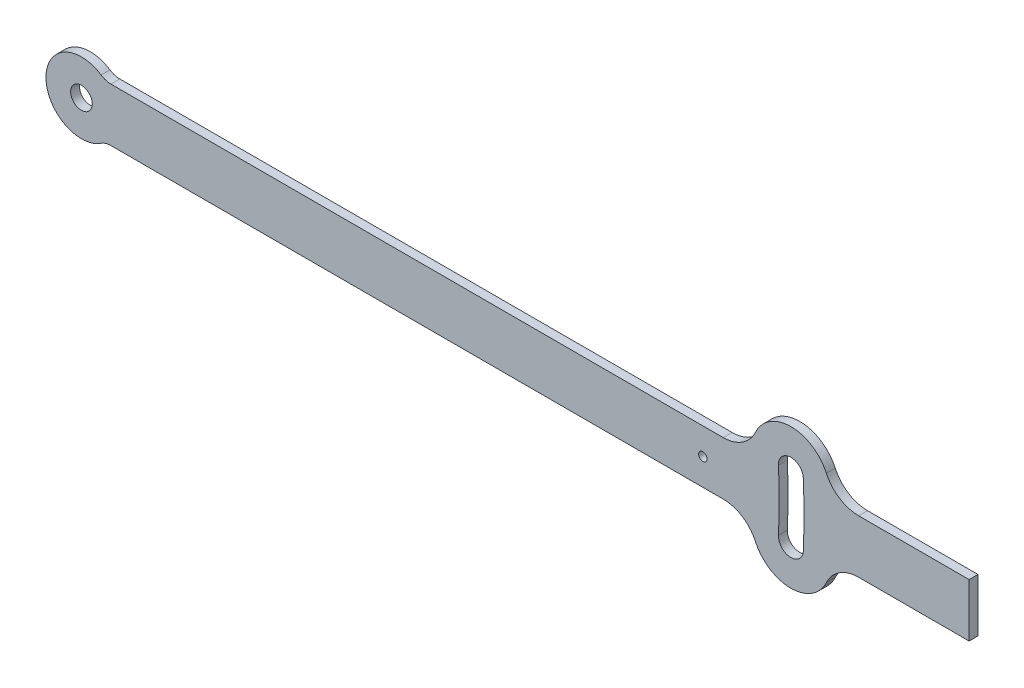
ISO-10303-21;
HEADER;
FILE_DESCRIPTION(('STEP AP214'),'2;1');
FILE_NAME('part.step','',(''),(''),'','','');
FILE_SCHEMA(('AUTOMOTIVE_DESIGN { 1 0 10303 214 1 1 1 1 }'));
ENDSEC;
DATA;
#1=APPLICATION_CONTEXT('core data for automotive mechanical design processes');
#2=APPLICATION_PROTOCOL_DEFINITION('international standard','automotive_design',2000,#1);
#3=PRODUCT_CONTEXT('',#1,'mechanical');
#4=PRODUCT('Part','Part','',(#3));
#5=PRODUCT_RELATED_PRODUCT_CATEGORY('part','',(#4));
#6=PRODUCT_DEFINITION_FORMATION('','',#4);
#7=PRODUCT_DEFINITION_CONTEXT('part definition',#1,'design');
#8=PRODUCT_DEFINITION('design','',#6,#7);
#9=PRODUCT_DEFINITION_SHAPE('','',#8);
#10=(LENGTH_UNIT() NAMED_UNIT(*) SI_UNIT(.MILLI.,.METRE.));
#11=(NAMED_UNIT(*) PLANE_ANGLE_UNIT() SI_UNIT($,.RADIAN.));
#12=(NAMED_UNIT(*) SI_UNIT($,.STERADIAN.) SOLID_ANGLE_UNIT());
#13=UNCERTAINTY_MEASURE_WITH_UNIT(LENGTH_MEASURE(1.E-05),#10,'distance_accuracy_value','');
#14=(GEOMETRIC_REPRESENTATION_CONTEXT(3) GLOBAL_UNCERTAINTY_ASSIGNED_CONTEXT((#13)) GLOBAL_UNIT_ASSIGNED_CONTEXT((#10,
#11,#12)) REPRESENTATION_CONTEXT('',''));
#15=CARTESIAN_POINT('',(0.,0.,0.));
#16=DIRECTION('',(0.,0.,1.));
#17=DIRECTION('',(1.,0.,0.));
#18=AXIS2_PLACEMENT_3D('',#15,#16,#17);
#19=CARTESIAN_POINT('',(0.,0.,5.));
#20=DIRECTION('',(0.,0.,1.));
#21=DIRECTION('',(1.,0.,0.));
#22=AXIS2_PLACEMENT_3D('',#19,#20,#21);
#23=PLANE('',#22);
#24=CARTESIAN_POINT('',(0.,0.,5.));
#25=DIRECTION('',(0.,0.,-1.));
#26=DIRECTION('',(1.,0.,0.));
#27=AXIS2_PLACEMENT_3D('',#24,#25,#26);
#28=CIRCLE('',#27,393.);
#29=CARTESIAN_POINT('',(392.62595108167,17.1424192345742,5.));
#30=VERTEX_POINT('',#29);
#31=CARTESIAN_POINT('',(392.62595108167,-17.1424192345742,5.));
#32=VERTEX_POINT('',#31);
#33=EDGE_CURVE('E169',#30,#32,#28,.T.);
#34=ORIENTED_EDGE('',*,*,#33,.F.);
#35=CARTESIAN_POINT('',(399.619288632743,17.4477549461316,5.));
#36=DIRECTION('',(0.,0.,1.));
#37=DIRECTION('',(1.,0.,0.));
#38=AXIS2_PLACEMENT_3D('',#35,#36,#37);
#39=CIRCLE('',#38,7.);
#40=CARTESIAN_POINT('',(406.612626183816,17.7530906576888,5.));
#41=VERTEX_POINT('',#40);
#42=EDGE_CURVE('E159',#41,#30,#39,.T.);
#43=ORIENTED_EDGE('',*,*,#42,.F.);
#44=CARTESIAN_POINT('',(0.,0.,5.));
#45=DIRECTION('',(0.,0.,1.));
#46=DIRECTION('',(1.,0.,0.));
#47=AXIS2_PLACEMENT_3D('',#44,#45,#46);
#48=CIRCLE('',#47,407.);
#49=CARTESIAN_POINT('',(406.612626183816,-17.7530906576889,5.));
#50=VERTEX_POINT('',#49);
#51=EDGE_CURVE('E185',#50,#41,#48,.T.);
#52=ORIENTED_EDGE('',*,*,#51,.F.);
#53=CARTESIAN_POINT('',(399.619288632743,-17.4477549461315,5.));
#54=DIRECTION('',(0.,0.,1.));
#55=DIRECTION('',(1.,0.,0.));
#56=AXIS2_PLACEMENT_3D('',#53,#54,#55);
#57=CIRCLE('',#56,6.99999999999997);
#58=EDGE_CURVE('E183',#32,#50,#57,.T.);
#59=ORIENTED_EDGE('',*,*,#58,.F.);
#60=EDGE_LOOP('',(#34,#43,#52,#59));
#61=FACE_BOUND('',#60,.T.);
#62=CARTESIAN_POINT('',(0.,0.,5.));
#63=DIRECTION('',(0.,0.,1.));
#64=DIRECTION('',(1.,0.,0.));
#65=AXIS2_PLACEMENT_3D('',#62,#63,#64);
#66=CIRCLE('',#65,6.1);
#67=CARTESIAN_POINT('',(6.1,0.,5.));
#68=VERTEX_POINT('',#67);
#69=EDGE_CURVE('E203',#68,#68,#66,.T.);
#70=ORIENTED_EDGE('',*,*,#69,.F.);
#71=EDGE_LOOP('',(#70));
#72=FACE_BOUND('',#71,.T.);
#73=CARTESIAN_POINT('',(399.619288632743,17.4477549461316,5.));
#74=DIRECTION('',(0.,0.,1.));
#75=DIRECTION('',(1.,0.,0.));
#76=AXIS2_PLACEMENT_3D('',#73,#74,#75);
#77=CIRCLE('',#76,22.);
#78=CARTESIAN_POINT('',(419.606028109827,26.6417880695865,5.));
#79=VERTEX_POINT('',#78);
#80=CARTESIAN_POINT('',(379.63254915566,26.6417880695865,5.));
#81=VERTEX_POINT('',#80);
#82=EDGE_CURVE('E225',#79,#81,#77,.T.);
#83=ORIENTED_EDGE('',*,*,#82,.T.);
#84=CARTESIAN_POINT('',(361.462785994674,35.,5.));
#85=DIRECTION('',(0.,0.,1.));
#86=DIRECTION('',(1.,0.,0.));
#87=AXIS2_PLACEMENT_3D('',#84,#85,#86);
#88=CIRCLE('',#87,20.);
#89=CARTESIAN_POINT('',(361.462785994674,15.,5.));
#90=VERTEX_POINT('',#89);
#91=EDGE_CURVE('E303',#81,#90,#88,.F.);
#92=ORIENTED_EDGE('',*,*,#91,.T.);
#93=DIRECTION('',(-1.,0.,0.));
#94=VECTOR('',#93,1.);
#95=CARTESIAN_POINT('',(13.228756555323,15.,5.));
#96=LINE('',#95,#94);
#97=CARTESIAN_POINT('',(16.583123951777,15.,5.));
#98=VERTEX_POINT('',#97);
#99=EDGE_CURVE('E228',#90,#98,#96,.T.);
#100=ORIENTED_EDGE('',*,*,#99,.T.);
#101=CARTESIAN_POINT('',(16.583123951777,25.,5.));
#102=DIRECTION('',(0.,0.,1.));
#103=DIRECTION('',(1.,0.,0.));
#104=AXIS2_PLACEMENT_3D('',#101,#102,#103);
#105=CIRCLE('',#104,10.);
#106=CARTESIAN_POINT('',(11.0554159678513,16.6666666666667,5.));
#107=VERTEX_POINT('',#106);
#108=EDGE_CURVE('E272',#98,#107,#105,.F.);
#109=ORIENTED_EDGE('',*,*,#108,.T.);
#110=CARTESIAN_POINT('',(0.,0.,5.));
#111=DIRECTION('',(0.,0.,1.));
#112=DIRECTION('',(1.,0.,0.));
#113=AXIS2_PLACEMENT_3D('',#110,#111,#112);
#114=CIRCLE('',#113,20.);
#115=CARTESIAN_POINT('',(11.0554159678513,-16.6666666666667,5.));
#116=VERTEX_POINT('',#115);
#117=EDGE_CURVE('E209',#107,#116,#114,.T.);
#118=ORIENTED_EDGE('',*,*,#117,.T.);
#119=CARTESIAN_POINT('',(16.583123951777,-25.,5.));
#120=DIRECTION('',(0.,0.,1.));
#121=DIRECTION('',(1.,0.,0.));
#122=AXIS2_PLACEMENT_3D('',#119,#120,#121);
#123=CIRCLE('',#122,10.);
#124=CARTESIAN_POINT('',(16.583123951777,-15.,5.));
#125=VERTEX_POINT('',#124);
#126=EDGE_CURVE('E267',#116,#125,#123,.F.);
#127=ORIENTED_EDGE('',*,*,#126,.T.);
#128=DIRECTION('',(1.,0.,0.));
#129=VECTOR('',#128,1.);
#130=CARTESIAN_POINT('',(13.228756555323,-15.,5.));
#131=LINE('',#130,#129);
#132=CARTESIAN_POINT('',(361.462785994674,-15.,5.));
#133=VERTEX_POINT('',#132);
#134=EDGE_CURVE('E212',#125,#133,#131,.T.);
#135=ORIENTED_EDGE('',*,*,#134,.T.);
#136=CARTESIAN_POINT('',(361.462785994674,-35.,5.));
#137=DIRECTION('',(0.,0.,1.));
#138=DIRECTION('',(1.,0.,0.));
#139=AXIS2_PLACEMENT_3D('',#136,#137,#138);
#140=CIRCLE('',#139,20.);
#141=CARTESIAN_POINT('',(379.63254915566,-26.6417880695864,5.));
#142=VERTEX_POINT('',#141);
#143=EDGE_CURVE('E11',#133,#142,#140,.F.);
#144=ORIENTED_EDGE('',*,*,#143,.T.);
#145=CARTESIAN_POINT('',(399.619288632743,-17.4477549461315,5.));
#146=DIRECTION('',(0.,0.,1.));
#147=DIRECTION('',(1.,0.,0.));
#148=AXIS2_PLACEMENT_3D('',#145,#146,#147);
#149=CIRCLE('',#148,22.);
#150=CARTESIAN_POINT('',(419.606028109827,-26.6417880695864,5.));
#151=VERTEX_POINT('',#150);
#152=EDGE_CURVE('E215',#142,#151,#149,.T.);
#153=ORIENTED_EDGE('',*,*,#152,.T.);
#154=CARTESIAN_POINT('',(437.775791270812,-35.,5.));
#155=DIRECTION('',(0.,0.,1.));
#156=DIRECTION('',(1.,0.,0.));
#157=AXIS2_PLACEMENT_3D('',#154,#155,#156);
#158=CIRCLE('',#157,20.);
#159=CARTESIAN_POINT('',(437.775791270812,-15.,5.));
#160=VERTEX_POINT('',#159);
#161=EDGE_CURVE('E299',#151,#160,#158,.F.);
#162=ORIENTED_EDGE('',*,*,#161,.T.);
#163=DIRECTION('',(1.,0.,0.));
#164=VECTOR('',#163,1.);
#165=CARTESIAN_POINT('',(500.,-15.,5.));
#166=LINE('',#165,#164);
#167=CARTESIAN_POINT('',(500.,-15.,5.));
#168=VERTEX_POINT('',#167);
#169=EDGE_CURVE('E218',#160,#168,#166,.T.);
#170=ORIENTED_EDGE('',*,*,#169,.T.);
#171=DIRECTION('',(0.,1.,0.));
#172=VECTOR('',#171,1.);
#173=CARTESIAN_POINT('',(500.,15.,5.));
#174=LINE('',#173,#172);
#175=CARTESIAN_POINT('',(500.,15.,5.));
#176=VERTEX_POINT('',#175);
#177=EDGE_CURVE('E220',#168,#176,#174,.T.);
#178=ORIENTED_EDGE('',*,*,#177,.T.);
#179=DIRECTION('',(-1.,0.,0.));
#180=VECTOR('',#179,1.);
#181=CARTESIAN_POINT('',(500.,15.,5.));
#182=LINE('',#181,#180);
#183=CARTESIAN_POINT('',(437.775791270812,15.,5.));
#184=VERTEX_POINT('',#183);
#185=EDGE_CURVE('E222',#176,#184,#182,.T.);
#186=ORIENTED_EDGE('',*,*,#185,.T.);
#187=CARTESIAN_POINT('',(437.775791270812,35.,5.));
#188=DIRECTION('',(0.,0.,1.));
#189=DIRECTION('',(1.,0.,0.));
#190=AXIS2_PLACEMENT_3D('',#187,#188,#189);
#191=CIRCLE('',#190,20.);
#192=EDGE_CURVE('E295',#184,#79,#191,.F.);
#193=ORIENTED_EDGE('',*,*,#192,.T.);
#194=EDGE_LOOP('',(#83,#92,#100,#109,#118,#127,#135,#144,#153,#162,#170,#178,#186,#193));
#195=FACE_BOUND('',#194,.T.);
#196=CARTESIAN_POINT('',(350.,0.,5.));
#197=DIRECTION('',(0.,0.,1.));
#198=DIRECTION('',(1.,0.,0.));
#199=AXIS2_PLACEMENT_3D('',#196,#197,#198);
#200=CIRCLE('',#199,2.40000000000003);
#201=CARTESIAN_POINT('',(352.4,0.,5.));
#202=VERTEX_POINT('',#201);
#203=EDGE_CURVE('E192',#202,#202,#200,.T.);
#204=ORIENTED_EDGE('',*,*,#203,.F.);
#205=EDGE_LOOP('',(#204));
#206=FACE_BOUND('',#205,.T.);
#207=ADVANCED_FACE('F33',(#61,#72,#195,#206),#23,.T.);
#208=CARTESIAN_POINT('',(0.,0.,0.));
#209=DIRECTION('',(0.,0.,1.));
#210=DIRECTION('',(1.,0.,0.));
#211=AXIS2_PLACEMENT_3D('',#208,#209,#210);
#212=PLANE('',#211);
#213=CARTESIAN_POINT('',(0.,0.,0.));
#214=DIRECTION('',(0.,0.,1.));
#215=DIRECTION('',(1.,0.,0.));
#216=AXIS2_PLACEMENT_3D('',#213,#214,#215);
#217=CIRCLE('',#216,6.1);
#218=CARTESIAN_POINT('',(6.1,0.,0.));
#219=VERTEX_POINT('',#218);
#220=EDGE_CURVE('E177',#219,#219,#217,.T.);
#221=ORIENTED_EDGE('',*,*,#220,.T.);
#222=EDGE_LOOP('',(#221));
#223=FACE_BOUND('',#222,.T.);
#224=CARTESIAN_POINT('',(0.,0.,0.));
#225=DIRECTION('',(0.,0.,1.));
#226=DIRECTION('',(1.,0.,0.));
#227=AXIS2_PLACEMENT_3D('',#224,#225,#226);
#228=CIRCLE('',#227,20.);
#229=CARTESIAN_POINT('',(11.0554159678513,16.6666666666667,0.));
#230=VERTEX_POINT('',#229);
#231=CARTESIAN_POINT('',(11.0554159678513,-16.6666666666667,0.));
#232=VERTEX_POINT('',#231);
#233=EDGE_CURVE('E206',#230,#232,#228,.T.);
#234=ORIENTED_EDGE('',*,*,#233,.F.);
#235=CARTESIAN_POINT('',(16.583123951777,25.,0.));
#236=DIRECTION('',(0.,0.,1.));
#237=DIRECTION('',(1.,0.,0.));
#238=AXIS2_PLACEMENT_3D('',#235,#236,#237);
#239=CIRCLE('',#238,10.);
#240=CARTESIAN_POINT('',(16.583123951777,15.,0.));
#241=VERTEX_POINT('',#240);
#242=EDGE_CURVE('E269',#230,#241,#239,.T.);
#243=ORIENTED_EDGE('',*,*,#242,.T.);
#244=DIRECTION('',(-1.,0.,0.));
#245=VECTOR('',#244,1.);
#246=CARTESIAN_POINT('',(13.228756555323,15.,0.));
#247=LINE('',#246,#245);
#248=CARTESIAN_POINT('',(361.462785994674,15.,0.));
#249=VERTEX_POINT('',#248);
#250=EDGE_CURVE('E213',#249,#241,#247,.T.);
#251=ORIENTED_EDGE('',*,*,#250,.F.);
#252=CARTESIAN_POINT('',(361.462785994674,35.,0.));
#253=DIRECTION('',(0.,0.,1.));
#254=DIRECTION('',(1.,0.,0.));
#255=AXIS2_PLACEMENT_3D('',#252,#253,#254);
#256=CIRCLE('',#255,20.);
#257=CARTESIAN_POINT('',(379.63254915566,26.6417880695865,0.));
#258=VERTEX_POINT('',#257);
#259=EDGE_CURVE('E301',#249,#258,#256,.T.);
#260=ORIENTED_EDGE('',*,*,#259,.T.);
#261=CARTESIAN_POINT('',(399.619288632743,17.4477549461316,0.));
#262=DIRECTION('',(0.,0.,1.));
#263=DIRECTION('',(1.,0.,0.));
#264=AXIS2_PLACEMENT_3D('',#261,#262,#263);
#265=CIRCLE('',#264,22.);
#266=CARTESIAN_POINT('',(419.606028109827,26.6417880695865,0.));
#267=VERTEX_POINT('',#266);
#268=EDGE_CURVE('E245',#267,#258,#265,.T.);
#269=ORIENTED_EDGE('',*,*,#268,.F.);
#270=CARTESIAN_POINT('',(437.775791270812,35.,0.));
#271=DIRECTION('',(0.,0.,1.));
#272=DIRECTION('',(1.,0.,0.));
#273=AXIS2_PLACEMENT_3D('',#270,#271,#272);
#274=CIRCLE('',#273,20.);
#275=CARTESIAN_POINT('',(437.775791270812,15.,0.));
#276=VERTEX_POINT('',#275);
#277=EDGE_CURVE('E293',#267,#276,#274,.T.);
#278=ORIENTED_EDGE('',*,*,#277,.T.);
#279=DIRECTION('',(-1.,0.,0.));
#280=VECTOR('',#279,1.);
#281=CARTESIAN_POINT('',(500.,15.,0.));
#282=LINE('',#281,#280);
#283=CARTESIAN_POINT('',(500.,15.,0.));
#284=VERTEX_POINT('',#283);
#285=EDGE_CURVE('E242',#284,#276,#282,.T.);
#286=ORIENTED_EDGE('',*,*,#285,.F.);
#287=DIRECTION('',(0.,1.,0.));
#288=VECTOR('',#287,1.);
#289=CARTESIAN_POINT('',(500.,15.,0.));
#290=LINE('',#289,#288);
#291=CARTESIAN_POINT('',(500.,-15.,0.));
#292=VERTEX_POINT('',#291);
#293=EDGE_CURVE('E240',#292,#284,#290,.T.);
#294=ORIENTED_EDGE('',*,*,#293,.F.);
#295=DIRECTION('',(1.,0.,0.));
#296=VECTOR('',#295,1.);
#297=CARTESIAN_POINT('',(500.,-15.,0.));
#298=LINE('',#297,#296);
#299=CARTESIAN_POINT('',(437.775791270812,-15.,0.));
#300=VERTEX_POINT('',#299);
#301=EDGE_CURVE('E238',#300,#292,#298,.T.);
#302=ORIENTED_EDGE('',*,*,#301,.F.);
#303=CARTESIAN_POINT('',(437.775791270812,-35.,0.));
#304=DIRECTION('',(0.,0.,1.));
#305=DIRECTION('',(1.,0.,0.));
#306=AXIS2_PLACEMENT_3D('',#303,#304,#305);
#307=CIRCLE('',#306,20.);
#308=CARTESIAN_POINT('',(419.606028109827,-26.6417880695864,0.));
#309=VERTEX_POINT('',#308);
#310=EDGE_CURVE('E297',#300,#309,#307,.T.);
#311=ORIENTED_EDGE('',*,*,#310,.T.);
#312=CARTESIAN_POINT('',(399.619288632743,-17.4477549461315,0.));
#313=DIRECTION('',(0.,0.,1.));
#314=DIRECTION('',(1.,0.,0.));
#315=AXIS2_PLACEMENT_3D('',#312,#313,#314);
#316=CIRCLE('',#315,22.);
#317=CARTESIAN_POINT('',(379.63254915566,-26.6417880695864,0.));
#318=VERTEX_POINT('',#317);
#319=EDGE_CURVE('E235',#318,#309,#316,.T.);
#320=ORIENTED_EDGE('',*,*,#319,.F.);
#321=CARTESIAN_POINT('',(361.462785994674,-35.,0.));
#322=DIRECTION('',(0.,0.,1.));
#323=DIRECTION('',(1.,0.,0.));
#324=AXIS2_PLACEMENT_3D('',#321,#322,#323);
#325=CIRCLE('',#324,20.);
#326=CARTESIAN_POINT('',(361.462785994674,-15.,0.));
#327=VERTEX_POINT('',#326);
#328=EDGE_CURVE('E41',#318,#327,#325,.T.);
#329=ORIENTED_EDGE('',*,*,#328,.T.);
#330=DIRECTION('',(1.,0.,0.));
#331=VECTOR('',#330,1.);
#332=CARTESIAN_POINT('',(13.228756555323,-15.,0.));
#333=LINE('',#332,#331);
#334=CARTESIAN_POINT('',(16.583123951777,-15.,0.));
#335=VERTEX_POINT('',#334);
#336=EDGE_CURVE('E233',#335,#327,#333,.T.);
#337=ORIENTED_EDGE('',*,*,#336,.F.);
#338=CARTESIAN_POINT('',(16.583123951777,-25.,0.));
#339=DIRECTION('',(0.,0.,1.));
#340=DIRECTION('',(1.,0.,0.));
#341=AXIS2_PLACEMENT_3D('',#338,#339,#340);
#342=CIRCLE('',#341,10.);
#343=EDGE_CURVE('E265',#335,#232,#342,.T.);
#344=ORIENTED_EDGE('',*,*,#343,.T.);
#345=EDGE_LOOP('',(#234,#243,#251,#260,#269,#278,#286,#294,#302,#311,#320,#329,#337,#344));
#346=FACE_BOUND('',#345,.T.);
#347=CARTESIAN_POINT('',(399.619288632743,17.4477549461316,0.));
#348=DIRECTION('',(0.,0.,1.));
#349=DIRECTION('',(1.,0.,0.));
#350=AXIS2_PLACEMENT_3D('',#347,#348,#349);
#351=CIRCLE('',#350,7.);
#352=CARTESIAN_POINT('',(406.612626183816,17.7530906576888,0.));
#353=VERTEX_POINT('',#352);
#354=CARTESIAN_POINT('',(392.62595108167,17.1424192345742,0.));
#355=VERTEX_POINT('',#354);
#356=EDGE_CURVE('E190',#353,#355,#351,.T.);
#357=ORIENTED_EDGE('',*,*,#356,.T.);
#358=CARTESIAN_POINT('',(0.,0.,0.));
#359=DIRECTION('',(0.,0.,-1.));
#360=DIRECTION('',(1.,0.,0.));
#361=AXIS2_PLACEMENT_3D('',#358,#359,#360);
#362=CIRCLE('',#361,393.);
#363=CARTESIAN_POINT('',(392.62595108167,-17.1424192345742,0.));
#364=VERTEX_POINT('',#363);
#365=EDGE_CURVE('E176',#355,#364,#362,.T.);
#366=ORIENTED_EDGE('',*,*,#365,.T.);
#367=CARTESIAN_POINT('',(399.619288632743,-17.4477549461315,0.));
#368=DIRECTION('',(0.,0.,1.));
#369=DIRECTION('',(1.,0.,0.));
#370=AXIS2_PLACEMENT_3D('',#367,#368,#369);
#371=CIRCLE('',#370,6.99999999999997);
#372=CARTESIAN_POINT('',(406.612626183816,-17.7530906576889,0.));
#373=VERTEX_POINT('',#372);
#374=EDGE_CURVE('E194',#364,#373,#371,.T.);
#375=ORIENTED_EDGE('',*,*,#374,.T.);
#376=CARTESIAN_POINT('',(0.,0.,0.));
#377=DIRECTION('',(0.,0.,1.));
#378=DIRECTION('',(1.,0.,0.));
#379=AXIS2_PLACEMENT_3D('',#376,#377,#378);
#380=CIRCLE('',#379,407.);
#381=EDGE_CURVE('E170',#373,#353,#380,.T.);
#382=ORIENTED_EDGE('',*,*,#381,.T.);
#383=EDGE_LOOP('',(#357,#366,#375,#382));
#384=FACE_BOUND('',#383,.T.);
#385=CARTESIAN_POINT('',(350.,0.,0.));
#386=DIRECTION('',(0.,0.,1.));
#387=DIRECTION('',(1.,0.,0.));
#388=AXIS2_PLACEMENT_3D('',#385,#386,#387);
#389=CIRCLE('',#388,2.40000000000003);
#390=CARTESIAN_POINT('',(352.4,0.,0.));
#391=VERTEX_POINT('',#390);
#392=EDGE_CURVE('E552',#391,#391,#389,.T.);
#393=ORIENTED_EDGE('',*,*,#392,.T.);
#394=EDGE_LOOP('',(#393));
#395=FACE_BOUND('',#394,.T.);
#396=ADVANCED_FACE('F320',(#223,#346,#384,#395),#212,.F.);
#397=CARTESIAN_POINT('',(0.,0.,5.));
#398=DIRECTION('',(0.,0.,-1.));
#399=DIRECTION('',(-1.,0.,0.));
#400=AXIS2_PLACEMENT_3D('',#397,#398,#399);
#401=CYLINDRICAL_SURFACE('',#400,20.);
#402=ORIENTED_EDGE('',*,*,#233,.T.);
#403=DIRECTION('',(0.,0.,-1.));
#404=VECTOR('',#403,1.);
#405=CARTESIAN_POINT('',(11.0554159678513,-16.6666666666667,5.));
#406=LINE('',#405,#404);
#407=EDGE_CURVE('E260',#232,#116,#406,.F.);
#408=ORIENTED_EDGE('',*,*,#407,.T.);
#409=ORIENTED_EDGE('',*,*,#117,.F.);
#410=DIRECTION('',(0.,0.,-1.));
#411=VECTOR('',#410,1.);
#412=CARTESIAN_POINT('',(11.0554159678513,16.6666666666667,5.));
#413=LINE('',#412,#411);
#414=EDGE_CURVE('E257',#107,#230,#413,.T.);
#415=ORIENTED_EDGE('',*,*,#414,.T.);
#416=EDGE_LOOP('',(#402,#408,#409,#415));
#417=FACE_BOUND('',#416,.T.);
#418=ADVANCED_FACE('F363',(#417),#401,.T.);
#419=CARTESIAN_POINT('',(13.228756555323,-15.,5.));
#420=DIRECTION('',(0.,1.,0.));
#421=DIRECTION('',(0.,0.,1.));
#422=AXIS2_PLACEMENT_3D('',#419,#420,#421);
#423=PLANE('',#422);
#424=ORIENTED_EDGE('',*,*,#336,.T.);
#425=DIRECTION('',(0.,0.,1.));
#426=VECTOR('',#425,1.);
#427=CARTESIAN_POINT('',(361.462785994674,-15.,5.));
#428=LINE('',#427,#426);
#429=EDGE_CURVE('E54',#327,#133,#428,.T.);
#430=ORIENTED_EDGE('',*,*,#429,.T.);
#431=ORIENTED_EDGE('',*,*,#134,.F.);
#432=DIRECTION('',(0.,0.,1.));
#433=VECTOR('',#432,1.);
#434=CARTESIAN_POINT('',(16.583123951777,-15.,0.));
#435=LINE('',#434,#433);
#436=EDGE_CURVE('E254',#125,#335,#435,.F.);
#437=ORIENTED_EDGE('',*,*,#436,.T.);
#438=EDGE_LOOP('',(#424,#430,#431,#437));
#439=FACE_BOUND('',#438,.T.);
#440=ADVANCED_FACE('F382',(#439),#423,.F.);
#441=CARTESIAN_POINT('',(399.619288632743,-17.4477549461315,5.));
#442=DIRECTION('',(0.,0.,-1.));
#443=DIRECTION('',(-1.,0.,0.));
#444=AXIS2_PLACEMENT_3D('',#441,#442,#443);
#445=CYLINDRICAL_SURFACE('',#444,22.);
#446=ORIENTED_EDGE('',*,*,#319,.T.);
#447=DIRECTION('',(0.,0.,-1.));
#448=VECTOR('',#447,1.);
#449=CARTESIAN_POINT('',(419.606028109827,-26.6417880695864,5.));
#450=LINE('',#449,#448);
#451=EDGE_CURVE('E287',#309,#151,#450,.F.);
#452=ORIENTED_EDGE('',*,*,#451,.T.);
#453=ORIENTED_EDGE('',*,*,#152,.F.);
#454=DIRECTION('',(0.,0.,-1.));
#455=VECTOR('',#454,1.);
#456=CARTESIAN_POINT('',(379.63254915566,-26.6417880695864,5.));
#457=LINE('',#456,#455);
#458=EDGE_CURVE('E284',#142,#318,#457,.T.);
#459=ORIENTED_EDGE('',*,*,#458,.T.);
#460=EDGE_LOOP('',(#446,#452,#453,#459));
#461=FACE_BOUND('',#460,.T.);
#462=ADVANCED_FACE('F350',(#461),#445,.T.);
#463=CARTESIAN_POINT('',(500.,-15.,5.));
#464=DIRECTION('',(0.,1.,0.));
#465=DIRECTION('',(-1.,0.,0.));
#466=AXIS2_PLACEMENT_3D('',#463,#464,#465);
#467=PLANE('',#466);
#468=ORIENTED_EDGE('',*,*,#169,.F.);
#469=DIRECTION('',(0.,0.,1.));
#470=VECTOR('',#469,1.);
#471=CARTESIAN_POINT('',(437.775791270812,-15.,0.));
#472=LINE('',#471,#470);
#473=EDGE_CURVE('E281',#160,#300,#472,.F.);
#474=ORIENTED_EDGE('',*,*,#473,.T.);
#475=ORIENTED_EDGE('',*,*,#301,.T.);
#476=DIRECTION('',(0.,0.,-1.));
#477=VECTOR('',#476,1.);
#478=CARTESIAN_POINT('',(500.,-15.,5.));
#479=LINE('',#478,#477);
#480=EDGE_CURVE('E251',#168,#292,#479,.T.);
#481=ORIENTED_EDGE('',*,*,#480,.F.);
#482=EDGE_LOOP('',(#468,#474,#475,#481));
#483=FACE_BOUND('',#482,.T.);
#484=ADVANCED_FACE('F342',(#483),#467,.F.);
#485=CARTESIAN_POINT('',(500.,15.,5.));
#486=DIRECTION('',(-1.,0.,0.));
#487=DIRECTION('',(0.,0.,1.));
#488=AXIS2_PLACEMENT_3D('',#485,#486,#487);
#489=PLANE('',#488);
#490=ORIENTED_EDGE('',*,*,#293,.T.);
#491=DIRECTION('',(0.,0.,-1.));
#492=VECTOR('',#491,1.);
#493=CARTESIAN_POINT('',(500.,15.,5.));
#494=LINE('',#493,#492);
#495=EDGE_CURVE('E230',#176,#284,#494,.T.);
#496=ORIENTED_EDGE('',*,*,#495,.F.);
#497=ORIENTED_EDGE('',*,*,#177,.F.);
#498=ORIENTED_EDGE('',*,*,#480,.T.);
#499=EDGE_LOOP('',(#490,#496,#497,#498));
#500=FACE_BOUND('',#499,.T.);
#501=ADVANCED_FACE('F337',(#500),#489,.F.);
#502=CARTESIAN_POINT('',(500.,15.,5.));
#503=DIRECTION('',(0.,-1.,0.));
#504=DIRECTION('',(1.,0.,0.));
#505=AXIS2_PLACEMENT_3D('',#502,#503,#504);
#506=PLANE('',#505);
#507=ORIENTED_EDGE('',*,*,#285,.T.);
#508=DIRECTION('',(0.,0.,1.));
#509=VECTOR('',#508,1.);
#510=CARTESIAN_POINT('',(437.775791270812,15.,5.));
#511=LINE('',#510,#509);
#512=EDGE_CURVE('E279',#276,#184,#511,.T.);
#513=ORIENTED_EDGE('',*,*,#512,.T.);
#514=ORIENTED_EDGE('',*,*,#185,.F.);
#515=ORIENTED_EDGE('',*,*,#495,.T.);
#516=EDGE_LOOP('',(#507,#513,#514,#515));
#517=FACE_BOUND('',#516,.T.);
#518=ADVANCED_FACE('F332',(#517),#506,.F.);
#519=CARTESIAN_POINT('',(399.619288632743,17.4477549461316,5.));
#520=DIRECTION('',(0.,0.,-1.));
#521=DIRECTION('',(-1.,0.,0.));
#522=AXIS2_PLACEMENT_3D('',#519,#520,#521);
#523=CYLINDRICAL_SURFACE('',#522,22.);
#524=ORIENTED_EDGE('',*,*,#82,.F.);
#525=DIRECTION('',(0.,0.,-1.));
#526=VECTOR('',#525,1.);
#527=CARTESIAN_POINT('',(419.606028109827,26.6417880695865,5.));
#528=LINE('',#527,#526);
#529=EDGE_CURVE('E276',#79,#267,#528,.T.);
#530=ORIENTED_EDGE('',*,*,#529,.T.);
#531=ORIENTED_EDGE('',*,*,#268,.T.);
#532=DIRECTION('',(0.,0.,-1.));
#533=VECTOR('',#532,1.);
#534=CARTESIAN_POINT('',(379.63254915566,26.6417880695865,5.));
#535=LINE('',#534,#533);
#536=EDGE_CURVE('E274',#258,#81,#535,.F.);
#537=ORIENTED_EDGE('',*,*,#536,.T.);
#538=EDGE_LOOP('',(#524,#530,#531,#537));
#539=FACE_BOUND('',#538,.T.);
#540=ADVANCED_FACE('F323',(#539),#523,.T.);
#541=CARTESIAN_POINT('',(13.228756555323,15.,5.));
#542=DIRECTION('',(0.,-1.,0.));
#543=DIRECTION('',(0.,0.,-1.));
#544=AXIS2_PLACEMENT_3D('',#541,#542,#543);
#545=PLANE('',#544);
#546=ORIENTED_EDGE('',*,*,#99,.F.);
#547=DIRECTION('',(0.,0.,1.));
#548=VECTOR('',#547,1.);
#549=CARTESIAN_POINT('',(361.462785994674,15.,0.));
#550=LINE('',#549,#548);
#551=EDGE_CURVE('E289',#90,#249,#550,.F.);
#552=ORIENTED_EDGE('',*,*,#551,.T.);
#553=ORIENTED_EDGE('',*,*,#250,.T.);
#554=DIRECTION('',(0.,0.,1.));
#555=VECTOR('',#554,1.);
#556=CARTESIAN_POINT('',(16.583123951777,15.,5.));
#557=LINE('',#556,#555);
#558=EDGE_CURVE('E262',#241,#98,#557,.T.);
#559=ORIENTED_EDGE('',*,*,#558,.T.);
#560=EDGE_LOOP('',(#546,#552,#553,#559));
#561=FACE_BOUND('',#560,.T.);
#562=ADVANCED_FACE('F313',(#561),#545,.F.);
#563=CARTESIAN_POINT('',(0.,0.,5.));
#564=DIRECTION('',(0.,0.,-1.));
#565=DIRECTION('',(-1.,0.,0.));
#566=AXIS2_PLACEMENT_3D('',#563,#564,#565);
#567=CYLINDRICAL_SURFACE('',#566,6.1);
#568=ORIENTED_EDGE('',*,*,#69,.T.);
#569=EDGE_LOOP('',(#568));
#570=FACE_BOUND('',#569,.T.);
#571=ORIENTED_EDGE('',*,*,#220,.F.);
#572=EDGE_LOOP('',(#571));
#573=FACE_BOUND('',#572,.T.);
#574=ADVANCED_FACE('F367',(#570,#573),#567,.F.);
#575=CARTESIAN_POINT('',(399.619288632743,17.4477549461316,5.));
#576=DIRECTION('',(0.,0.,-1.));
#577=DIRECTION('',(-1.,0.,0.));
#578=AXIS2_PLACEMENT_3D('',#575,#576,#577);
#579=CYLINDRICAL_SURFACE('',#578,7.);
#580=ORIENTED_EDGE('',*,*,#356,.F.);
#581=DIRECTION('',(0.,0.,-1.));
#582=VECTOR('',#581,1.);
#583=CARTESIAN_POINT('',(406.612626183816,17.7530906576888,5.));
#584=LINE('',#583,#582);
#585=EDGE_CURVE('E165',#41,#353,#584,.T.);
#586=ORIENTED_EDGE('',*,*,#585,.F.);
#587=ORIENTED_EDGE('',*,*,#42,.T.);
#588=DIRECTION('',(0.,0.,-1.));
#589=VECTOR('',#588,1.);
#590=CARTESIAN_POINT('',(392.62595108167,17.1424192345742,5.));
#591=LINE('',#590,#589);
#592=EDGE_CURVE('E162',#30,#355,#591,.T.);
#593=ORIENTED_EDGE('',*,*,#592,.T.);
#594=EDGE_LOOP('',(#580,#586,#587,#593));
#595=FACE_BOUND('',#594,.T.);
#596=ADVANCED_FACE('F161',(#595),#579,.F.);
#597=CARTESIAN_POINT('',(0.,0.,5.));
#598=DIRECTION('',(0.,0.,-1.));
#599=DIRECTION('',(-1.,0.,0.));
#600=AXIS2_PLACEMENT_3D('',#597,#598,#599);
#601=CYLINDRICAL_SURFACE('',#600,393.);
#602=ORIENTED_EDGE('',*,*,#365,.F.);
#603=ORIENTED_EDGE('',*,*,#592,.F.);
#604=ORIENTED_EDGE('',*,*,#33,.T.);
#605=DIRECTION('',(0.,0.,-1.));
#606=VECTOR('',#605,1.);
#607=CARTESIAN_POINT('',(392.62595108167,-17.1424192345742,5.));
#608=LINE('',#607,#606);
#609=EDGE_CURVE('E178',#32,#364,#608,.T.);
#610=ORIENTED_EDGE('',*,*,#609,.T.);
#611=EDGE_LOOP('',(#602,#603,#604,#610));
#612=FACE_BOUND('',#611,.T.);
#613=ADVANCED_FACE('F173',(#612),#601,.T.);
#614=CARTESIAN_POINT('',(399.619288632743,-17.4477549461315,5.));
#615=DIRECTION('',(0.,0.,-1.));
#616=DIRECTION('',(-1.,0.,0.));
#617=AXIS2_PLACEMENT_3D('',#614,#615,#616);
#618=CYLINDRICAL_SURFACE('',#617,6.99999999999997);
#619=ORIENTED_EDGE('',*,*,#374,.F.);
#620=ORIENTED_EDGE('',*,*,#609,.F.);
#621=ORIENTED_EDGE('',*,*,#58,.T.);
#622=DIRECTION('',(0.,0.,-1.));
#623=VECTOR('',#622,1.);
#624=CARTESIAN_POINT('',(406.612626183816,-17.7530906576889,5.));
#625=LINE('',#624,#623);
#626=EDGE_CURVE('E200',#50,#373,#625,.T.);
#627=ORIENTED_EDGE('',*,*,#626,.T.);
#628=EDGE_LOOP('',(#619,#620,#621,#627));
#629=FACE_BOUND('',#628,.T.);
#630=ADVANCED_FACE('F449',(#629),#618,.F.);
#631=CARTESIAN_POINT('',(0.,0.,5.));
#632=DIRECTION('',(0.,0.,-1.));
#633=DIRECTION('',(-1.,0.,0.));
#634=AXIS2_PLACEMENT_3D('',#631,#632,#633);
#635=CYLINDRICAL_SURFACE('',#634,407.);
#636=ORIENTED_EDGE('',*,*,#381,.F.);
#637=ORIENTED_EDGE('',*,*,#626,.F.);
#638=ORIENTED_EDGE('',*,*,#51,.T.);
#639=ORIENTED_EDGE('',*,*,#585,.T.);
#640=EDGE_LOOP('',(#636,#637,#638,#639));
#641=FACE_BOUND('',#640,.T.);
#642=ADVANCED_FACE('F440',(#641),#635,.F.);
#643=CARTESIAN_POINT('',(350.,0.,5.));
#644=DIRECTION('',(0.,0.,-1.));
#645=DIRECTION('',(-1.,0.,0.));
#646=AXIS2_PLACEMENT_3D('',#643,#644,#645);
#647=CYLINDRICAL_SURFACE('',#646,2.40000000000003);
#648=ORIENTED_EDGE('',*,*,#203,.T.);
#649=EDGE_LOOP('',(#648));
#650=FACE_BOUND('',#649,.T.);
#651=ORIENTED_EDGE('',*,*,#392,.F.);
#652=EDGE_LOOP('',(#651));
#653=FACE_BOUND('',#652,.T.);
#654=ADVANCED_FACE('F392',(#650,#653),#647,.F.);
#655=CARTESIAN_POINT('',(16.583123951777,-25.,5.));
#656=DIRECTION('',(0.,0.,-1.));
#657=DIRECTION('',(-1.,0.,0.));
#658=AXIS2_PLACEMENT_3D('',#655,#656,#657);
#659=CYLINDRICAL_SURFACE('',#658,10.);
#660=ORIENTED_EDGE('',*,*,#126,.F.);
#661=ORIENTED_EDGE('',*,*,#407,.F.);
#662=ORIENTED_EDGE('',*,*,#343,.F.);
#663=ORIENTED_EDGE('',*,*,#436,.F.);
#664=EDGE_LOOP('',(#660,#661,#662,#663));
#665=FACE_BOUND('',#664,.T.);
#666=ADVANCED_FACE('F388',(#665),#659,.F.);
#667=CARTESIAN_POINT('',(16.583123951777,25.,5.));
#668=DIRECTION('',(0.,0.,-1.));
#669=DIRECTION('',(-1.,0.,0.));
#670=AXIS2_PLACEMENT_3D('',#667,#668,#669);
#671=CYLINDRICAL_SURFACE('',#670,10.);
#672=ORIENTED_EDGE('',*,*,#108,.F.);
#673=ORIENTED_EDGE('',*,*,#558,.F.);
#674=ORIENTED_EDGE('',*,*,#242,.F.);
#675=ORIENTED_EDGE('',*,*,#414,.F.);
#676=EDGE_LOOP('',(#672,#673,#674,#675));
#677=FACE_BOUND('',#676,.T.);
#678=ADVANCED_FACE('F391',(#677),#671,.F.);
#679=CARTESIAN_POINT('',(437.775791270812,35.,5.));
#680=DIRECTION('',(0.,0.,-1.));
#681=DIRECTION('',(-1.,0.,0.));
#682=AXIS2_PLACEMENT_3D('',#679,#680,#681);
#683=CYLINDRICAL_SURFACE('',#682,20.);
#684=ORIENTED_EDGE('',*,*,#192,.F.);
#685=ORIENTED_EDGE('',*,*,#512,.F.);
#686=ORIENTED_EDGE('',*,*,#277,.F.);
#687=ORIENTED_EDGE('',*,*,#529,.F.);
#688=EDGE_LOOP('',(#684,#685,#686,#687));
#689=FACE_BOUND('',#688,.T.);
#690=ADVANCED_FACE('F327',(#689),#683,.F.);
#691=CARTESIAN_POINT('',(437.775791270812,-35.,5.));
#692=DIRECTION('',(0.,0.,-1.));
#693=DIRECTION('',(-1.,0.,0.));
#694=AXIS2_PLACEMENT_3D('',#691,#692,#693);
#695=CYLINDRICAL_SURFACE('',#694,20.);
#696=ORIENTED_EDGE('',*,*,#161,.F.);
#697=ORIENTED_EDGE('',*,*,#451,.F.);
#698=ORIENTED_EDGE('',*,*,#310,.F.);
#699=ORIENTED_EDGE('',*,*,#473,.F.);
#700=EDGE_LOOP('',(#696,#697,#698,#699));
#701=FACE_BOUND('',#700,.T.);
#702=ADVANCED_FACE('F346',(#701),#695,.F.);
#703=CARTESIAN_POINT('',(361.462785994674,35.,5.));
#704=DIRECTION('',(0.,0.,-1.));
#705=DIRECTION('',(-1.,0.,0.));
#706=AXIS2_PLACEMENT_3D('',#703,#704,#705);
#707=CYLINDRICAL_SURFACE('',#706,20.);
#708=ORIENTED_EDGE('',*,*,#91,.F.);
#709=ORIENTED_EDGE('',*,*,#536,.F.);
#710=ORIENTED_EDGE('',*,*,#259,.F.);
#711=ORIENTED_EDGE('',*,*,#551,.F.);
#712=EDGE_LOOP('',(#708,#709,#710,#711));
#713=FACE_BOUND('',#712,.T.);
#714=ADVANCED_FACE('F317',(#713),#707,.F.);
#715=CARTESIAN_POINT('',(361.462785994674,-35.,5.));
#716=DIRECTION('',(0.,0.,-1.));
#717=DIRECTION('',(-1.,0.,0.));
#718=AXIS2_PLACEMENT_3D('',#715,#716,#717);
#719=CYLINDRICAL_SURFACE('',#718,20.);
#720=ORIENTED_EDGE('',*,*,#143,.F.);
#721=ORIENTED_EDGE('',*,*,#429,.F.);
#722=ORIENTED_EDGE('',*,*,#328,.F.);
#723=ORIENTED_EDGE('',*,*,#458,.F.);
#724=EDGE_LOOP('',(#720,#721,#722,#723));
#725=FACE_BOUND('',#724,.T.);
#726=ADVANCED_FACE('F35',(#725),#719,.F.);
#727=CLOSED_SHELL('',(#207,#396,#418,#440,#462,#484,#501,#518,#540,#562,#574,#596,#613,#630,
#642,#654,#666,#678,#690,#702,#714,#726));
#728=MANIFOLD_SOLID_BREP('B2',#727);
#729=ADVANCED_BREP_SHAPE_REPRESENTATION('',(#18,#728),#14);
#730=SHAPE_DEFINITION_REPRESENTATION(#9,#729);
ENDSEC;
END-ISO-10303-21;
